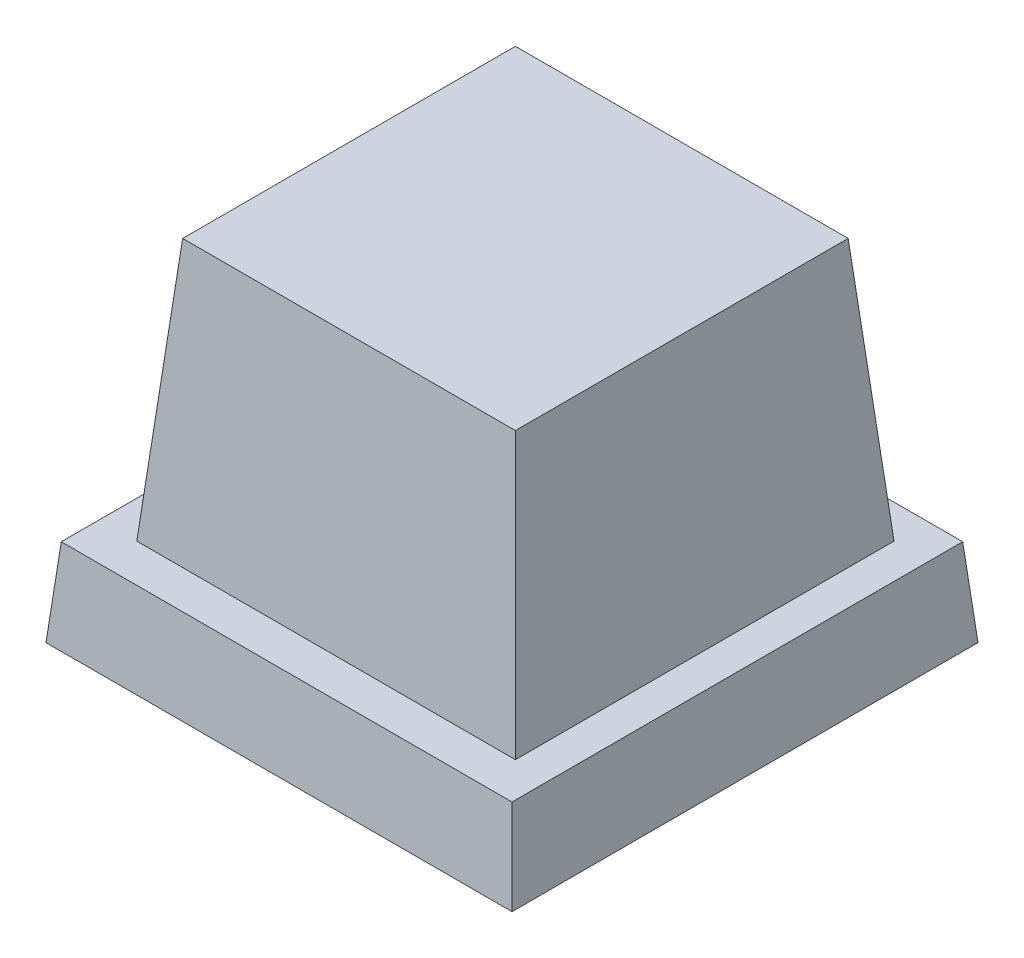
ISO-10303-21;
HEADER;
FILE_DESCRIPTION(('STEP AP214'),'2;1');
FILE_NAME('part.step','',(''),(''),'','','');
FILE_SCHEMA(('AUTOMOTIVE_DESIGN { 1 0 10303 214 1 1 1 1 }'));
ENDSEC;
DATA;
#1=APPLICATION_CONTEXT('core data for automotive mechanical design processes');
#2=APPLICATION_PROTOCOL_DEFINITION('international standard','automotive_design',2000,#1);
#3=PRODUCT_CONTEXT('',#1,'mechanical');
#4=PRODUCT('Part','Part','',(#3));
#5=PRODUCT_RELATED_PRODUCT_CATEGORY('part','',(#4));
#6=PRODUCT_DEFINITION_FORMATION('','',#4);
#7=PRODUCT_DEFINITION_CONTEXT('part definition',#1,'design');
#8=PRODUCT_DEFINITION('design','',#6,#7);
#9=PRODUCT_DEFINITION_SHAPE('','',#8);
#10=(LENGTH_UNIT() NAMED_UNIT(*) SI_UNIT(.MILLI.,.METRE.));
#11=(NAMED_UNIT(*) PLANE_ANGLE_UNIT() SI_UNIT($,.RADIAN.));
#12=(NAMED_UNIT(*) SI_UNIT($,.STERADIAN.) SOLID_ANGLE_UNIT());
#13=UNCERTAINTY_MEASURE_WITH_UNIT(LENGTH_MEASURE(1.E-05),#10,'distance_accuracy_value','');
#14=(GEOMETRIC_REPRESENTATION_CONTEXT(3) GLOBAL_UNCERTAINTY_ASSIGNED_CONTEXT((#13)) GLOBAL_UNIT_ASSIGNED_CONTEXT((#10,
#11,#12)) REPRESENTATION_CONTEXT('',''));
#15=CARTESIAN_POINT('',(0.,0.,0.));
#16=DIRECTION('',(0.,0.,1.));
#17=DIRECTION('',(1.,0.,0.));
#18=AXIS2_PLACEMENT_3D('',#15,#16,#17);
#19=CARTESIAN_POINT('',(0.,0.,0.));
#20=DIRECTION('',(0.996194698091746,0.0871557427476582,0.));
#21=DIRECTION('',(-0.0871557427476582,0.996194698091746,0.));
#22=AXIS2_PLACEMENT_3D('',#19,#20,#21);
#23=PLANE('',#22);
#24=DIRECTION('',(0.,0.,-1.));
#25=VECTOR('',#24,1.);
#26=CARTESIAN_POINT('',(0.,0.,0.));
#27=LINE('',#26,#25);
#28=CARTESIAN_POINT('',(0.,0.,0.));
#29=VERTEX_POINT('',#28);
#30=CARTESIAN_POINT('',(0.,0.,-32.));
#31=VERTEX_POINT('',#30);
#32=EDGE_CURVE('E233',#29,#31,#27,.T.);
#33=ORIENTED_EDGE('',*,*,#32,.T.);
#34=DIRECTION('',(0.0868265938642476,-0.992432509138967,-0.0868265938642477));
#35=VECTOR('',#34,1.);
#36=CARTESIAN_POINT('',(0.,0.,-32.));
#37=LINE('',#36,#35);
#38=CARTESIAN_POINT('',(-0.524931981155544,6.,-31.4750680188445));
#39=VERTEX_POINT('',#38);
#40=EDGE_CURVE('E11',#39,#31,#37,.T.);
#41=ORIENTED_EDGE('',*,*,#40,.F.);
#42=DIRECTION('',(0.,0.,1.));
#43=VECTOR('',#42,1.);
#44=CARTESIAN_POINT('',(-0.524931981155544,6.,0.));
#45=LINE('',#44,#43);
#46=CARTESIAN_POINT('',(-0.524931981155544,6.,-0.524931981155544));
#47=VERTEX_POINT('',#46);
#48=EDGE_CURVE('E258',#47,#39,#45,.F.);
#49=ORIENTED_EDGE('',*,*,#48,.F.);
#50=DIRECTION('',(0.0868265938642476,-0.992432509138967,0.0868265938642476));
#51=VECTOR('',#50,1.);
#52=CARTESIAN_POINT('',(0.,0.,0.));
#53=LINE('',#52,#51);
#54=EDGE_CURVE('E260',#47,#29,#53,.T.);
#55=ORIENTED_EDGE('',*,*,#54,.T.);
#56=EDGE_LOOP('',(#33,#41,#49,#55));
#57=FACE_BOUND('',#56,.T.);
#58=ADVANCED_FACE('F33',(#57),#23,.T.);
#59=CARTESIAN_POINT('',(0.,0.,-32.));
#60=DIRECTION('',(0.,0.0871557427476582,-0.996194698091746));
#61=DIRECTION('',(0.,0.996194698091746,0.0871557427476582));
#62=AXIS2_PLACEMENT_3D('',#59,#60,#61);
#63=PLANE('',#62);
#64=DIRECTION('',(-1.,0.,0.));
#65=VECTOR('',#64,1.);
#66=CARTESIAN_POINT('',(0.,0.,-32.));
#67=LINE('',#66,#65);
#68=CARTESIAN_POINT('',(-32.,0.,-32.));
#69=VERTEX_POINT('',#68);
#70=EDGE_CURVE('E253',#31,#69,#67,.T.);
#71=ORIENTED_EDGE('',*,*,#70,.T.);
#72=DIRECTION('',(-0.0868265938642476,-0.992432509138967,-0.0868265938642476));
#73=VECTOR('',#72,1.);
#74=CARTESIAN_POINT('',(-31.7587565631339,2.75742510107793,-31.7587565631339));
#75=LINE('',#74,#73);
#76=CARTESIAN_POINT('',(-31.4750680188445,6.,-31.4750680188445));
#77=VERTEX_POINT('',#76);
#78=EDGE_CURVE('E42',#77,#69,#75,.T.);
#79=ORIENTED_EDGE('',*,*,#78,.F.);
#80=DIRECTION('',(1.,0.,0.));
#81=VECTOR('',#80,1.);
#82=CARTESIAN_POINT('',(0.,6.,-31.4750680188445));
#83=LINE('',#82,#81);
#84=EDGE_CURVE('E270',#39,#77,#83,.F.);
#85=ORIENTED_EDGE('',*,*,#84,.F.);
#86=ORIENTED_EDGE('',*,*,#40,.T.);
#87=EDGE_LOOP('',(#71,#79,#85,#86));
#88=FACE_BOUND('',#87,.T.);
#89=ADVANCED_FACE('F35',(#88),#63,.T.);
#90=CARTESIAN_POINT('',(-32.,0.,0.));
#91=DIRECTION('',(-0.996194698091746,0.0871557427476582,0.));
#92=DIRECTION('',(-0.0871557427476582,-0.996194698091746,0.));
#93=AXIS2_PLACEMENT_3D('',#90,#91,#92);
#94=PLANE('',#93);
#95=DIRECTION('',(0.,0.,1.));
#96=VECTOR('',#95,1.);
#97=CARTESIAN_POINT('',(-32.,0.,0.));
#98=LINE('',#97,#96);
#99=CARTESIAN_POINT('',(-32.,0.,0.));
#100=VERTEX_POINT('',#99);
#101=EDGE_CURVE('E255',#69,#100,#98,.T.);
#102=ORIENTED_EDGE('',*,*,#101,.T.);
#103=DIRECTION('',(-0.0868265938642476,-0.992432509138967,0.0868265938642476));
#104=VECTOR('',#103,1.);
#105=CARTESIAN_POINT('',(-31.7587565631339,2.75742510107793,-0.241243436866144));
#106=LINE('',#105,#104);
#107=CARTESIAN_POINT('',(-31.4750680188445,6.,-0.524931981155544));
#108=VERTEX_POINT('',#107);
#109=EDGE_CURVE('E263',#108,#100,#106,.T.);
#110=ORIENTED_EDGE('',*,*,#109,.F.);
#111=DIRECTION('',(0.,0.,-1.));
#112=VECTOR('',#111,1.);
#113=CARTESIAN_POINT('',(-31.4750680188445,6.,0.));
#114=LINE('',#113,#112);
#115=EDGE_CURVE('E271',#77,#108,#114,.F.);
#116=ORIENTED_EDGE('',*,*,#115,.F.);
#117=ORIENTED_EDGE('',*,*,#78,.T.);
#118=EDGE_LOOP('',(#102,#110,#116,#117));
#119=FACE_BOUND('',#118,.T.);
#120=ADVANCED_FACE('F289',(#119),#94,.T.);
#121=CARTESIAN_POINT('',(0.,0.,0.));
#122=DIRECTION('',(0.,0.0871557427476582,0.996194698091746));
#123=DIRECTION('',(0.,-0.996194698091746,0.0871557427476582));
#124=AXIS2_PLACEMENT_3D('',#121,#122,#123);
#125=PLANE('',#124);
#126=DIRECTION('',(1.,0.,0.));
#127=VECTOR('',#126,1.);
#128=CARTESIAN_POINT('',(0.,0.,0.));
#129=LINE('',#128,#127);
#130=EDGE_CURVE('E257',#100,#29,#129,.T.);
#131=ORIENTED_EDGE('',*,*,#130,.T.);
#132=ORIENTED_EDGE('',*,*,#54,.F.);
#133=DIRECTION('',(-1.,0.,0.));
#134=VECTOR('',#133,1.);
#135=CARTESIAN_POINT('',(0.,6.,-0.524931981155544));
#136=LINE('',#135,#134);
#137=EDGE_CURVE('E37',#108,#47,#136,.F.);
#138=ORIENTED_EDGE('',*,*,#137,.F.);
#139=ORIENTED_EDGE('',*,*,#109,.T.);
#140=EDGE_LOOP('',(#131,#132,#138,#139));
#141=FACE_BOUND('',#140,.T.);
#142=ADVANCED_FACE('F281',(#141),#125,.T.);
#143=CARTESIAN_POINT('',(0.,6.,0.));
#144=DIRECTION('',(0.,1.,0.));
#145=DIRECTION('',(0.,0.,1.));
#146=AXIS2_PLACEMENT_3D('',#143,#144,#145);
#147=PLANE('',#146);
#148=DIRECTION('',(0.,0.,1.));
#149=VECTOR('',#148,1.);
#150=CARTESIAN_POINT('',(-28.9230767196855,6.,-29.1567421015639));
#151=LINE('',#150,#149);
#152=CARTESIAN_POINT('',(-28.9230767196855,6.,-29.1567421015639));
#153=VERTEX_POINT('',#152);
#154=CARTESIAN_POINT('',(-28.9230767196855,6.,-3.15674210156385));
#155=VERTEX_POINT('',#154);
#156=EDGE_CURVE('E58',#153,#155,#151,.T.);
#157=ORIENTED_EDGE('',*,*,#156,.F.);
#158=DIRECTION('',(-1.,0.,0.));
#159=VECTOR('',#158,1.);
#160=CARTESIAN_POINT('',(-28.9230767196855,6.,-29.1567421015639));
#161=LINE('',#160,#159);
#162=CARTESIAN_POINT('',(-2.92307671968546,6.,-29.1567421015639));
#163=VERTEX_POINT('',#162);
#164=EDGE_CURVE('E227',#163,#153,#161,.T.);
#165=ORIENTED_EDGE('',*,*,#164,.F.);
#166=DIRECTION('',(0.,0.,-1.));
#167=VECTOR('',#166,1.);
#168=CARTESIAN_POINT('',(-2.92307671968546,6.,-29.1567421015639));
#169=LINE('',#168,#167);
#170=CARTESIAN_POINT('',(-2.92307671968545,6.,-3.15674210156385));
#171=VERTEX_POINT('',#170);
#172=EDGE_CURVE('E224',#171,#163,#169,.T.);
#173=ORIENTED_EDGE('',*,*,#172,.F.);
#174=DIRECTION('',(1.,0.,0.));
#175=VECTOR('',#174,1.);
#176=CARTESIAN_POINT('',(-28.9230767196855,6.,-3.15674210156385));
#177=LINE('',#176,#175);
#178=EDGE_CURVE('E173',#155,#171,#177,.T.);
#179=ORIENTED_EDGE('',*,*,#178,.F.);
#180=EDGE_LOOP('',(#157,#165,#173,#179));
#181=FACE_BOUND('',#180,.T.);
#182=ORIENTED_EDGE('',*,*,#48,.T.);
#183=ORIENTED_EDGE('',*,*,#84,.T.);
#184=ORIENTED_EDGE('',*,*,#115,.T.);
#185=ORIENTED_EDGE('',*,*,#137,.T.);
#186=EDGE_LOOP('',(#182,#183,#184,#185));
#187=FACE_BOUND('',#186,.T.);
#188=ADVANCED_FACE('F277',(#181,#187),#147,.T.);
#189=CARTESIAN_POINT('',(0.,0.,0.));
#190=DIRECTION('',(0.,1.,0.));
#191=DIRECTION('',(0.,0.,1.));
#192=AXIS2_PLACEMENT_3D('',#189,#190,#191);
#193=PLANE('',#192);
#194=DIRECTION('',(-1.,0.,0.));
#195=VECTOR('',#194,1.);
#196=CARTESIAN_POINT('',(0.,0.,-0.803055870034678));
#197=LINE('',#196,#195);
#198=CARTESIAN_POINT('',(-31.1969441299653,0.,-0.803055870034678));
#199=VERTEX_POINT('',#198);
#200=CARTESIAN_POINT('',(-0.803055870034678,0.,-0.803055870034678));
#201=VERTEX_POINT('',#200);
#202=EDGE_CURVE('E166',#199,#201,#197,.F.);
#203=ORIENTED_EDGE('',*,*,#202,.T.);
#204=DIRECTION('',(0.,0.,1.));
#205=VECTOR('',#204,1.);
#206=CARTESIAN_POINT('',(-0.803055870034678,0.,0.));
#207=LINE('',#206,#205);
#208=CARTESIAN_POINT('',(-0.803055870034678,0.,-31.1969441299653));
#209=VERTEX_POINT('',#208);
#210=EDGE_CURVE('E199',#201,#209,#207,.F.);
#211=ORIENTED_EDGE('',*,*,#210,.T.);
#212=DIRECTION('',(1.,0.,0.));
#213=VECTOR('',#212,1.);
#214=CARTESIAN_POINT('',(0.,0.,-31.1969441299653));
#215=LINE('',#214,#213);
#216=CARTESIAN_POINT('',(-31.1969441299653,0.,-31.1969441299653));
#217=VERTEX_POINT('',#216);
#218=EDGE_CURVE('E170',#209,#217,#215,.F.);
#219=ORIENTED_EDGE('',*,*,#218,.T.);
#220=DIRECTION('',(0.,0.,-1.));
#221=VECTOR('',#220,1.);
#222=CARTESIAN_POINT('',(-31.1969441299653,0.,0.));
#223=LINE('',#222,#221);
#224=EDGE_CURVE('E50',#217,#199,#223,.F.);
#225=ORIENTED_EDGE('',*,*,#224,.T.);
#226=EDGE_LOOP('',(#203,#211,#219,#225));
#227=FACE_BOUND('',#226,.T.);
#228=ORIENTED_EDGE('',*,*,#32,.F.);
#229=ORIENTED_EDGE('',*,*,#130,.F.);
#230=ORIENTED_EDGE('',*,*,#101,.F.);
#231=ORIENTED_EDGE('',*,*,#70,.F.);
#232=EDGE_LOOP('',(#228,#229,#230,#231));
#233=FACE_BOUND('',#232,.T.);
#234=ADVANCED_FACE('F291',(#227,#233),#193,.F.);
#235=CARTESIAN_POINT('',(-28.9230767196855,6.,-29.1567421015639));
#236=DIRECTION('',(-0.996194698091745,0.0871557427476582,0.));
#237=DIRECTION('',(-0.0871557427476582,-0.996194698091746,0.));
#238=AXIS2_PLACEMENT_3D('',#235,#236,#237);
#239=PLANE('',#238);
#240=ORIENTED_EDGE('',*,*,#156,.T.);
#241=DIRECTION('',(-0.0868265938642476,-0.992432509138967,0.0868265938642476));
#242=VECTOR('',#241,1.);
#243=CARTESIAN_POINT('',(-28.9230767196855,6.,-3.15674210156385));
#244=LINE('',#243,#242);
#245=CARTESIAN_POINT('',(-27.3482807762188,24.,-4.73153804503048));
#246=VERTEX_POINT('',#245);
#247=EDGE_CURVE('E230',#246,#155,#244,.T.);
#248=ORIENTED_EDGE('',*,*,#247,.F.);
#249=DIRECTION('',(0.,0.,-1.));
#250=VECTOR('',#249,1.);
#251=CARTESIAN_POINT('',(-27.3482807762188,24.,-29.1567421015639));
#252=LINE('',#251,#250);
#253=CARTESIAN_POINT('',(-27.3482807762188,24.,-27.5819461580972));
#254=VERTEX_POINT('',#253);
#255=EDGE_CURVE('E229',#254,#246,#252,.F.);
#256=ORIENTED_EDGE('',*,*,#255,.F.);
#257=DIRECTION('',(-0.0868265938642476,-0.992432509138967,-0.0868265938642476));
#258=VECTOR('',#257,1.);
#259=CARTESIAN_POINT('',(-28.9230767196855,6.,-29.1567421015639));
#260=LINE('',#259,#258);
#261=EDGE_CURVE('E235',#254,#153,#260,.T.);
#262=ORIENTED_EDGE('',*,*,#261,.T.);
#263=EDGE_LOOP('',(#240,#248,#256,#262));
#264=FACE_BOUND('',#263,.T.);
#265=ADVANCED_FACE('F293',(#264),#239,.T.);
#266=CARTESIAN_POINT('',(-28.9230767196855,6.,-3.15674210156385));
#267=DIRECTION('',(0.,0.0871557427476582,0.996194698091745));
#268=DIRECTION('',(0.,-0.996194698091746,0.0871557427476582));
#269=AXIS2_PLACEMENT_3D('',#266,#267,#268);
#270=PLANE('',#269);
#271=ORIENTED_EDGE('',*,*,#178,.T.);
#272=DIRECTION('',(0.0868265938642476,-0.992432509138967,0.0868265938642476));
#273=VECTOR('',#272,1.);
#274=CARTESIAN_POINT('',(-3.1190870121392,8.24040789462582,-3.35275239401759));
#275=LINE('',#274,#273);
#276=CARTESIAN_POINT('',(-4.49787266315209,24.,-4.73153804503048));
#277=VERTEX_POINT('',#276);
#278=EDGE_CURVE('E234',#277,#171,#275,.T.);
#279=ORIENTED_EDGE('',*,*,#278,.F.);
#280=DIRECTION('',(-1.,0.,0.));
#281=VECTOR('',#280,1.);
#282=CARTESIAN_POINT('',(-28.9230767196855,24.,-4.73153804503048));
#283=LINE('',#282,#281);
#284=EDGE_CURVE('E246',#246,#277,#283,.F.);
#285=ORIENTED_EDGE('',*,*,#284,.F.);
#286=ORIENTED_EDGE('',*,*,#247,.T.);
#287=EDGE_LOOP('',(#271,#279,#285,#286));
#288=FACE_BOUND('',#287,.T.);
#289=ADVANCED_FACE('F300',(#288),#270,.T.);
#290=CARTESIAN_POINT('',(-2.92307671968546,6.,-29.1567421015639));
#291=DIRECTION('',(0.996194698091745,0.0871557427476582,0.));
#292=DIRECTION('',(-0.0871557427476582,0.996194698091746,0.));
#293=AXIS2_PLACEMENT_3D('',#290,#291,#292);
#294=PLANE('',#293);
#295=ORIENTED_EDGE('',*,*,#172,.T.);
#296=DIRECTION('',(0.0868265938642476,-0.992432509138967,-0.0868265938642476));
#297=VECTOR('',#296,1.);
#298=CARTESIAN_POINT('',(-3.1190870121392,8.24040789462582,-28.9607318091101));
#299=LINE('',#298,#297);
#300=CARTESIAN_POINT('',(-4.49787266315209,24.,-27.5819461580972));
#301=VERTEX_POINT('',#300);
#302=EDGE_CURVE('E238',#301,#163,#299,.T.);
#303=ORIENTED_EDGE('',*,*,#302,.F.);
#304=DIRECTION('',(0.,0.,1.));
#305=VECTOR('',#304,1.);
#306=CARTESIAN_POINT('',(-4.49787266315209,24.,-29.1567421015639));
#307=LINE('',#306,#305);
#308=EDGE_CURVE('E248',#277,#301,#307,.F.);
#309=ORIENTED_EDGE('',*,*,#308,.F.);
#310=ORIENTED_EDGE('',*,*,#278,.T.);
#311=EDGE_LOOP('',(#295,#303,#309,#310));
#312=FACE_BOUND('',#311,.T.);
#313=ADVANCED_FACE('F340',(#312),#294,.T.);
#314=CARTESIAN_POINT('',(-28.9230767196855,6.,-29.1567421015639));
#315=DIRECTION('',(0.,0.0871557427476582,-0.996194698091745));
#316=DIRECTION('',(0.,0.996194698091746,0.0871557427476582));
#317=AXIS2_PLACEMENT_3D('',#314,#315,#316);
#318=PLANE('',#317);
#319=ORIENTED_EDGE('',*,*,#164,.T.);
#320=ORIENTED_EDGE('',*,*,#261,.F.);
#321=DIRECTION('',(1.,0.,0.));
#322=VECTOR('',#321,1.);
#323=CARTESIAN_POINT('',(-28.9230767196855,24.,-27.5819461580972));
#324=LINE('',#323,#322);
#325=EDGE_CURVE('E239',#301,#254,#324,.F.);
#326=ORIENTED_EDGE('',*,*,#325,.F.);
#327=ORIENTED_EDGE('',*,*,#302,.T.);
#328=EDGE_LOOP('',(#319,#320,#326,#327));
#329=FACE_BOUND('',#328,.T.);
#330=ADVANCED_FACE('F350',(#329),#318,.T.);
#331=CARTESIAN_POINT('',(0.,24.,0.));
#332=DIRECTION('',(0.,1.,0.));
#333=DIRECTION('',(0.,0.,1.));
#334=AXIS2_PLACEMENT_3D('',#331,#332,#333);
#335=PLANE('',#334);
#336=ORIENTED_EDGE('',*,*,#255,.T.);
#337=ORIENTED_EDGE('',*,*,#284,.T.);
#338=ORIENTED_EDGE('',*,*,#308,.T.);
#339=ORIENTED_EDGE('',*,*,#325,.T.);
#340=EDGE_LOOP('',(#336,#337,#338,#339));
#341=FACE_BOUND('',#340,.T.);
#342=ADVANCED_FACE('F360',(#341),#335,.T.);
#343=CARTESIAN_POINT('',(-0.796955758473397,-0.0697245941981266,0.));
#344=DIRECTION('',(0.996194698091746,0.0871557427476582,0.));
#345=DIRECTION('',(-0.0871557427476582,0.996194698091746,0.));
#346=AXIS2_PLACEMENT_3D('',#343,#344,#345);
#347=PLANE('',#346);
#348=ORIENTED_EDGE('',*,*,#210,.F.);
#349=DIRECTION('',(0.0868265938642476,-0.992432509138967,0.0868265938642476));
#350=VECTOR('',#349,1.);
#351=CARTESIAN_POINT('',(-0.790947622654509,-0.1383979008501,-0.790947622654509));
#352=LINE('',#351,#350);
#353=CARTESIAN_POINT('',(-1.25799692036948,5.2,-1.25799692036948));
#354=VERTEX_POINT('',#353);
#355=EDGE_CURVE('E165',#354,#201,#352,.T.);
#356=ORIENTED_EDGE('',*,*,#355,.F.);
#357=DIRECTION('',(0.,0.,1.));
#358=VECTOR('',#357,1.);
#359=CARTESIAN_POINT('',(-1.25799692036948,5.2,0.));
#360=LINE('',#359,#358);
#361=CARTESIAN_POINT('',(-1.25799692036948,5.2,-30.7420030796305));
#362=VERTEX_POINT('',#361);
#363=EDGE_CURVE('E153',#354,#362,#360,.F.);
#364=ORIENTED_EDGE('',*,*,#363,.T.);
#365=DIRECTION('',(0.0868265938642476,-0.992432509138967,-0.0868265938642477));
#366=VECTOR('',#365,1.);
#367=CARTESIAN_POINT('',(-0.790947622654509,-0.1383979008501,-31.2090523773455));
#368=LINE('',#367,#366);
#369=EDGE_CURVE('E163',#362,#209,#368,.T.);
#370=ORIENTED_EDGE('',*,*,#369,.T.);
#371=EDGE_LOOP('',(#348,#356,#364,#370));
#372=FACE_BOUND('',#371,.T.);
#373=ADVANCED_FACE('F162',(#372),#347,.F.);
#374=CARTESIAN_POINT('',(0.,-0.0697245941981266,-31.2030442415266));
#375=DIRECTION('',(0.,0.0871557427476582,-0.996194698091746));
#376=DIRECTION('',(0.,0.996194698091746,0.0871557427476582));
#377=AXIS2_PLACEMENT_3D('',#374,#375,#376);
#378=PLANE('',#377);
#379=ORIENTED_EDGE('',*,*,#218,.F.);
#380=ORIENTED_EDGE('',*,*,#369,.F.);
#381=DIRECTION('',(1.,0.,0.));
#382=VECTOR('',#381,1.);
#383=CARTESIAN_POINT('',(0.,5.2,-30.7420030796305));
#384=LINE('',#383,#382);
#385=CARTESIAN_POINT('',(-30.7420030796305,5.2,-30.7420030796305));
#386=VERTEX_POINT('',#385);
#387=EDGE_CURVE('E149',#362,#386,#384,.F.);
#388=ORIENTED_EDGE('',*,*,#387,.T.);
#389=DIRECTION('',(-0.0868265938642476,-0.992432509138967,-0.0868265938642476));
#390=VECTOR('',#389,1.);
#391=CARTESIAN_POINT('',(-30.9678089404793,2.61902720022783,-30.9678089404794));
#392=LINE('',#391,#390);
#393=EDGE_CURVE('E171',#386,#217,#392,.T.);
#394=ORIENTED_EDGE('',*,*,#393,.T.);
#395=EDGE_LOOP('',(#379,#380,#388,#394));
#396=FACE_BOUND('',#395,.T.);
#397=ADVANCED_FACE('F168',(#396),#378,.F.);
#398=CARTESIAN_POINT('',(-31.2030442415266,-0.0697245941981266,0.));
#399=DIRECTION('',(-0.996194698091746,0.0871557427476582,0.));
#400=DIRECTION('',(-0.0871557427476582,-0.996194698091746,0.));
#401=AXIS2_PLACEMENT_3D('',#398,#399,#400);
#402=PLANE('',#401);
#403=ORIENTED_EDGE('',*,*,#224,.F.);
#404=ORIENTED_EDGE('',*,*,#393,.F.);
#405=DIRECTION('',(0.,0.,-1.));
#406=VECTOR('',#405,1.);
#407=CARTESIAN_POINT('',(-30.7420030796305,5.2,0.));
#408=LINE('',#407,#406);
#409=CARTESIAN_POINT('',(-30.7420030796305,5.2,-1.25799692036948));
#410=VERTEX_POINT('',#409);
#411=EDGE_CURVE('E154',#386,#410,#408,.F.);
#412=ORIENTED_EDGE('',*,*,#411,.T.);
#413=DIRECTION('',(-0.0868265938642476,-0.992432509138967,0.0868265938642476));
#414=VECTOR('',#413,1.);
#415=CARTESIAN_POINT('',(-30.9678089404794,2.61902720022783,-1.03219105952065));
#416=LINE('',#415,#414);
#417=EDGE_CURVE('E175',#410,#199,#416,.T.);
#418=ORIENTED_EDGE('',*,*,#417,.T.);
#419=EDGE_LOOP('',(#403,#404,#412,#418));
#420=FACE_BOUND('',#419,.T.);
#421=ADVANCED_FACE('F390',(#420),#402,.F.);
#422=CARTESIAN_POINT('',(0.,-0.0697245941981266,-0.796955758473397));
#423=DIRECTION('',(0.,0.0871557427476582,0.996194698091746));
#424=DIRECTION('',(0.,-0.996194698091746,0.0871557427476582));
#425=AXIS2_PLACEMENT_3D('',#422,#423,#424);
#426=PLANE('',#425);
#427=ORIENTED_EDGE('',*,*,#202,.F.);
#428=ORIENTED_EDGE('',*,*,#417,.F.);
#429=DIRECTION('',(-1.,0.,0.));
#430=VECTOR('',#429,1.);
#431=CARTESIAN_POINT('',(0.,5.2,-1.25799692036948));
#432=LINE('',#431,#430);
#433=EDGE_CURVE('E178',#410,#354,#432,.F.);
#434=ORIENTED_EDGE('',*,*,#433,.T.);
#435=ORIENTED_EDGE('',*,*,#355,.T.);
#436=EDGE_LOOP('',(#427,#428,#434,#435));
#437=FACE_BOUND('',#436,.T.);
#438=ADVANCED_FACE('F399',(#437),#426,.F.);
#439=CARTESIAN_POINT('',(0.,5.2,0.));
#440=DIRECTION('',(0.,1.,0.));
#441=DIRECTION('',(0.,0.,1.));
#442=AXIS2_PLACEMENT_3D('',#439,#440,#441);
#443=PLANE('',#442);
#444=DIRECTION('',(0.,0.,-1.));
#445=VECTOR('',#444,1.);
#446=CARTESIAN_POINT('',(-28.1900117804715,5.2,-29.1567421015639));
#447=LINE('',#446,#445);
#448=CARTESIAN_POINT('',(-28.1900117804715,5.2,-28.4236771623499));
#449=VERTEX_POINT('',#448);
#450=CARTESIAN_POINT('',(-28.1900117804715,5.2,-3.88980704077779));
#451=VERTEX_POINT('',#450);
#452=EDGE_CURVE('E183',#449,#451,#447,.F.);
#453=ORIENTED_EDGE('',*,*,#452,.T.);
#454=DIRECTION('',(-1.,0.,0.));
#455=VECTOR('',#454,1.);
#456=CARTESIAN_POINT('',(-28.9230767196855,5.2,-3.88980704077779));
#457=LINE('',#456,#455);
#458=CARTESIAN_POINT('',(-3.65614165889939,5.2,-3.88980704077779));
#459=VERTEX_POINT('',#458);
#460=EDGE_CURVE('E186',#451,#459,#457,.F.);
#461=ORIENTED_EDGE('',*,*,#460,.T.);
#462=DIRECTION('',(0.,0.,1.));
#463=VECTOR('',#462,1.);
#464=CARTESIAN_POINT('',(-3.6561416588994,5.2,-29.1567421015639));
#465=LINE('',#464,#463);
#466=CARTESIAN_POINT('',(-3.6561416588994,5.2,-28.4236771623499));
#467=VERTEX_POINT('',#466);
#468=EDGE_CURVE('E191',#459,#467,#465,.F.);
#469=ORIENTED_EDGE('',*,*,#468,.T.);
#470=DIRECTION('',(1.,0.,0.));
#471=VECTOR('',#470,1.);
#472=CARTESIAN_POINT('',(-28.9230767196855,5.2,-28.4236771623499));
#473=LINE('',#472,#471);
#474=EDGE_CURVE('E187',#467,#449,#473,.F.);
#475=ORIENTED_EDGE('',*,*,#474,.T.);
#476=EDGE_LOOP('',(#453,#461,#469,#475));
#477=FACE_BOUND('',#476,.T.);
#478=ORIENTED_EDGE('',*,*,#363,.F.);
#479=ORIENTED_EDGE('',*,*,#433,.F.);
#480=ORIENTED_EDGE('',*,*,#411,.F.);
#481=ORIENTED_EDGE('',*,*,#387,.F.);
#482=EDGE_LOOP('',(#478,#479,#480,#481));
#483=FACE_BOUND('',#482,.T.);
#484=ADVANCED_FACE('F151',(#477,#483),#443,.F.);
#485=CARTESIAN_POINT('',(-28.1261209612121,5.93027540580187,-29.1567421015639));
#486=DIRECTION('',(-0.996194698091745,0.0871557427476582,0.));
#487=DIRECTION('',(-0.0871557427476582,-0.996194698091746,0.));
#488=AXIS2_PLACEMENT_3D('',#485,#486,#487);
#489=PLANE('',#488);
#490=ORIENTED_EDGE('',*,*,#452,.F.);
#491=DIRECTION('',(-0.0868265938642476,-0.992432509138967,-0.0868265938642476));
#492=VECTOR('',#491,1.);
#493=CARTESIAN_POINT('',(-28.1321290970309,5.8616020991499,-28.3657944789093));
#494=LINE('',#493,#492);
#495=CARTESIAN_POINT('',(-26.6152158370049,23.2,-26.8488812188833));
#496=VERTEX_POINT('',#495);
#497=EDGE_CURVE('E204',#496,#449,#494,.T.);
#498=ORIENTED_EDGE('',*,*,#497,.F.);
#499=DIRECTION('',(0.,0.,-1.));
#500=VECTOR('',#499,1.);
#501=CARTESIAN_POINT('',(-26.6152158370049,23.2,-29.1567421015639));
#502=LINE('',#501,#500);
#503=CARTESIAN_POINT('',(-26.6152158370049,23.2,-5.46460298424442));
#504=VERTEX_POINT('',#503);
#505=EDGE_CURVE('E190',#496,#504,#502,.F.);
#506=ORIENTED_EDGE('',*,*,#505,.T.);
#507=DIRECTION('',(-0.0868265938642476,-0.992432509138967,0.0868265938642476));
#508=VECTOR('',#507,1.);
#509=CARTESIAN_POINT('',(-28.1321290970309,5.8616020991499,-3.94768972421836));
#510=LINE('',#509,#508);
#511=EDGE_CURVE('E196',#504,#451,#510,.T.);
#512=ORIENTED_EDGE('',*,*,#511,.T.);
#513=EDGE_LOOP('',(#490,#498,#506,#512));
#514=FACE_BOUND('',#513,.T.);
#515=ADVANCED_FACE('F417',(#514),#489,.F.);
#516=CARTESIAN_POINT('',(-28.9230767196855,5.93027540580187,-3.95369786003725));
#517=DIRECTION('',(0.,0.0871557427476582,0.996194698091745));
#518=DIRECTION('',(0.,-0.996194698091746,0.0871557427476582));
#519=AXIS2_PLACEMENT_3D('',#516,#517,#518);
#520=PLANE('',#519);
#521=ORIENTED_EDGE('',*,*,#460,.F.);
#522=ORIENTED_EDGE('',*,*,#511,.F.);
#523=DIRECTION('',(-1.,0.,0.));
#524=VECTOR('',#523,1.);
#525=CARTESIAN_POINT('',(-28.9230767196855,23.2,-5.46460298424442));
#526=LINE('',#525,#524);
#527=CARTESIAN_POINT('',(-5.23093760236603,23.2,-5.46460298424442));
#528=VERTEX_POINT('',#527);
#529=EDGE_CURVE('E203',#504,#528,#526,.F.);
#530=ORIENTED_EDGE('',*,*,#529,.T.);
#531=DIRECTION('',(0.0868265938642476,-0.992432509138967,0.0868265938642476));
#532=VECTOR('',#531,1.);
#533=CARTESIAN_POINT('',(-3.91003463479371,8.10200999377572,-4.1437000166721));
#534=LINE('',#533,#532);
#535=EDGE_CURVE('E200',#528,#459,#534,.T.);
#536=ORIENTED_EDGE('',*,*,#535,.T.);
#537=EDGE_LOOP('',(#521,#522,#530,#536));
#538=FACE_BOUND('',#537,.T.);
#539=ADVANCED_FACE('F427',(#538),#520,.F.);
#540=CARTESIAN_POINT('',(-3.72003247815885,5.93027540580187,-29.1567421015639));
#541=DIRECTION('',(0.996194698091745,0.0871557427476582,0.));
#542=DIRECTION('',(-0.0871557427476582,0.996194698091746,0.));
#543=AXIS2_PLACEMENT_3D('',#540,#541,#542);
#544=PLANE('',#543);
#545=ORIENTED_EDGE('',*,*,#468,.F.);
#546=ORIENTED_EDGE('',*,*,#535,.F.);
#547=DIRECTION('',(0.,0.,1.));
#548=VECTOR('',#547,1.);
#549=CARTESIAN_POINT('',(-5.23093760236603,23.2,-29.1567421015639));
#550=LINE('',#549,#548);
#551=CARTESIAN_POINT('',(-5.23093760236603,23.2,-26.8488812188833));
#552=VERTEX_POINT('',#551);
#553=EDGE_CURVE('E212',#528,#552,#550,.F.);
#554=ORIENTED_EDGE('',*,*,#553,.T.);
#555=DIRECTION('',(0.0868265938642476,-0.992432509138967,-0.0868265938642476));
#556=VECTOR('',#555,1.);
#557=CARTESIAN_POINT('',(-3.91003463479371,8.10200999377572,-28.1697841864556));
#558=LINE('',#557,#556);
#559=EDGE_CURVE('E207',#552,#467,#558,.T.);
#560=ORIENTED_EDGE('',*,*,#559,.T.);
#561=EDGE_LOOP('',(#545,#546,#554,#560));
#562=FACE_BOUND('',#561,.T.);
#563=ADVANCED_FACE('F437',(#562),#544,.F.);
#564=CARTESIAN_POINT('',(-28.9230767196855,5.93027540580187,-28.3597863430905));
#565=DIRECTION('',(0.,0.0871557427476582,-0.996194698091745));
#566=DIRECTION('',(0.,0.996194698091746,0.0871557427476582));
#567=AXIS2_PLACEMENT_3D('',#564,#565,#566);
#568=PLANE('',#567);
#569=ORIENTED_EDGE('',*,*,#474,.F.);
#570=ORIENTED_EDGE('',*,*,#559,.F.);
#571=DIRECTION('',(1.,0.,0.));
#572=VECTOR('',#571,1.);
#573=CARTESIAN_POINT('',(-28.9230767196855,23.2,-26.8488812188833));
#574=LINE('',#573,#572);
#575=EDGE_CURVE('E208',#552,#496,#574,.F.);
#576=ORIENTED_EDGE('',*,*,#575,.T.);
#577=ORIENTED_EDGE('',*,*,#497,.T.);
#578=EDGE_LOOP('',(#569,#570,#576,#577));
#579=FACE_BOUND('',#578,.T.);
#580=ADVANCED_FACE('F447',(#579),#568,.F.);
#581=CARTESIAN_POINT('',(0.,23.2,0.));
#582=DIRECTION('',(0.,1.,0.));
#583=DIRECTION('',(0.,0.,1.));
#584=AXIS2_PLACEMENT_3D('',#581,#582,#583);
#585=PLANE('',#584);
#586=ORIENTED_EDGE('',*,*,#505,.F.);
#587=ORIENTED_EDGE('',*,*,#575,.F.);
#588=ORIENTED_EDGE('',*,*,#553,.F.);
#589=ORIENTED_EDGE('',*,*,#529,.F.);
#590=EDGE_LOOP('',(#586,#587,#588,#589));
#591=FACE_BOUND('',#590,.T.);
#592=ADVANCED_FACE('F457',(#591),#585,.F.);
#593=CLOSED_SHELL('',(#58,#89,#120,#142,#188,#234,#265,#289,#313,#330,#342,#373,#397,#421,#438,
#484,#515,#539,#563,#580,#592));
#594=MANIFOLD_SOLID_BREP('B2',#593);
#595=ADVANCED_BREP_SHAPE_REPRESENTATION('',(#18,#594),#14);
#596=SHAPE_DEFINITION_REPRESENTATION(#9,#595);
ENDSEC;
END-ISO-10303-21;
